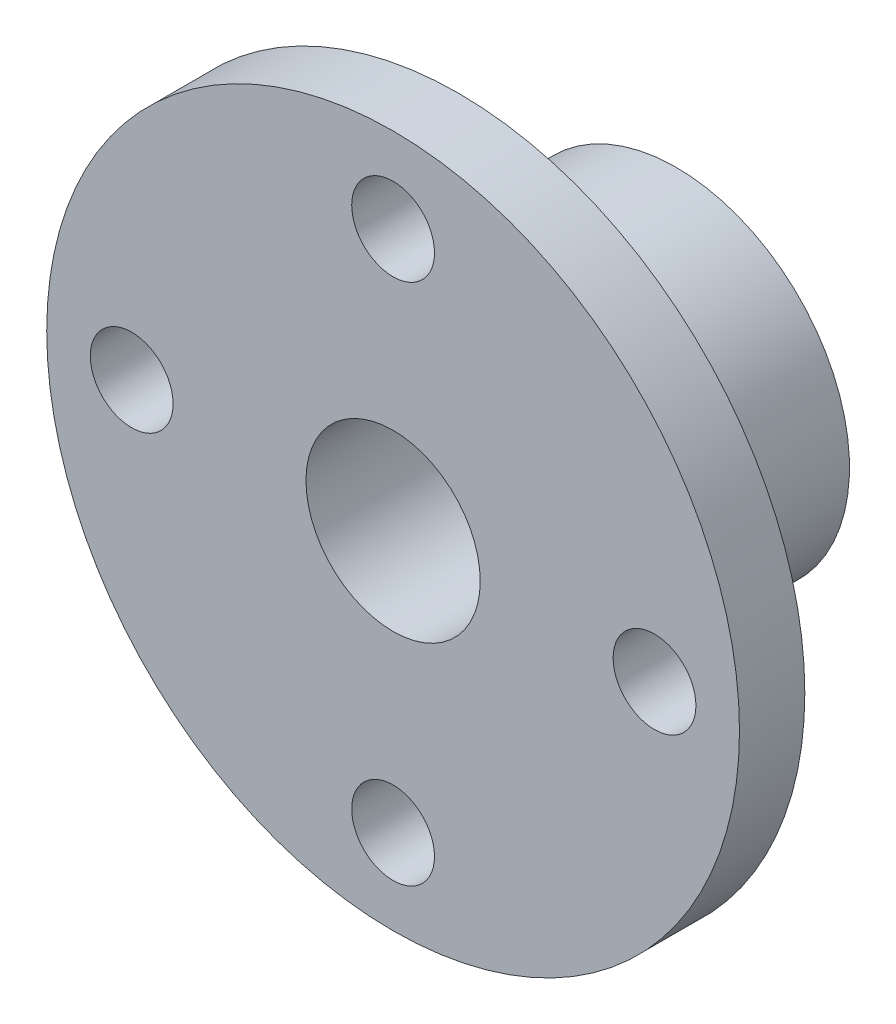
ISO-10303-21;
HEADER;
FILE_DESCRIPTION(('STEP AP214'),'2;1');
FILE_NAME('part.step','',(''),(''),'','','');
FILE_SCHEMA(('AUTOMOTIVE_DESIGN { 1 0 10303 214 1 1 1 1 }'));
ENDSEC;
DATA;
#1=APPLICATION_CONTEXT('core data for automotive mechanical design processes');
#2=APPLICATION_PROTOCOL_DEFINITION('international standard','automotive_design',2000,#1);
#3=PRODUCT_CONTEXT('',#1,'mechanical');
#4=PRODUCT('Part','Part','',(#3));
#5=PRODUCT_RELATED_PRODUCT_CATEGORY('part','',(#4));
#6=PRODUCT_DEFINITION_FORMATION('','',#4);
#7=PRODUCT_DEFINITION_CONTEXT('part definition',#1,'design');
#8=PRODUCT_DEFINITION('design','',#6,#7);
#9=PRODUCT_DEFINITION_SHAPE('','',#8);
#10=(LENGTH_UNIT() NAMED_UNIT(*) SI_UNIT(.MILLI.,.METRE.));
#11=(NAMED_UNIT(*) PLANE_ANGLE_UNIT() SI_UNIT($,.RADIAN.));
#12=(NAMED_UNIT(*) SI_UNIT($,.STERADIAN.) SOLID_ANGLE_UNIT());
#13=UNCERTAINTY_MEASURE_WITH_UNIT(LENGTH_MEASURE(1.E-05),#10,'distance_accuracy_value','');
#14=(GEOMETRIC_REPRESENTATION_CONTEXT(3) GLOBAL_UNCERTAINTY_ASSIGNED_CONTEXT((#13)) GLOBAL_UNIT_ASSIGNED_CONTEXT((#10,
#11,#12)) REPRESENTATION_CONTEXT('',''));
#15=CARTESIAN_POINT('',(0.,0.,0.));
#16=DIRECTION('',(0.,0.,1.));
#17=DIRECTION('',(1.,0.,0.));
#18=AXIS2_PLACEMENT_3D('',#15,#16,#17);
#19=CARTESIAN_POINT('',(0.,0.,3.));
#20=DIRECTION('',(0.,0.,-1.));
#21=DIRECTION('',(-1.,0.,0.));
#22=AXIS2_PLACEMENT_3D('',#19,#20,#21);
#23=CYLINDRICAL_SURFACE('',#22,15.9);
#24=CARTESIAN_POINT('',(0.,0.,3.));
#25=DIRECTION('',(0.,0.,1.));
#26=DIRECTION('',(1.,0.,0.));
#27=AXIS2_PLACEMENT_3D('',#24,#25,#26);
#28=CIRCLE('',#27,15.9);
#29=CARTESIAN_POINT('',(15.9,0.,3.));
#30=VERTEX_POINT('',#29);
#31=EDGE_CURVE('E39',#30,#30,#28,.T.);
#32=ORIENTED_EDGE('',*,*,#31,.F.);
#33=EDGE_LOOP('',(#32));
#34=FACE_BOUND('',#33,.T.);
#35=CARTESIAN_POINT('',(0.,0.,0.));
#36=DIRECTION('',(0.,0.,1.));
#37=DIRECTION('',(1.,0.,0.));
#38=AXIS2_PLACEMENT_3D('',#35,#36,#37);
#39=CIRCLE('',#38,15.9);
#40=CARTESIAN_POINT('',(15.9,0.,0.));
#41=VERTEX_POINT('',#40);
#42=EDGE_CURVE('E35',#41,#41,#39,.T.);
#43=ORIENTED_EDGE('',*,*,#42,.T.);
#44=EDGE_LOOP('',(#43));
#45=FACE_BOUND('',#44,.T.);
#46=ADVANCED_FACE('F32',(#34,#45),#23,.T.);
#47=CARTESIAN_POINT('',(0.,0.,3.));
#48=DIRECTION('',(0.,0.,1.));
#49=DIRECTION('',(1.,0.,0.));
#50=AXIS2_PLACEMENT_3D('',#47,#48,#49);
#51=PLANE('',#50);
#52=CARTESIAN_POINT('',(0.,12.,3.));
#53=DIRECTION('',(0.,0.,1.));
#54=DIRECTION('',(1.,0.,0.));
#55=AXIS2_PLACEMENT_3D('',#52,#53,#54);
#56=CIRCLE('',#55,1.9);
#57=CARTESIAN_POINT('',(1.9,12.,3.));
#58=VERTEX_POINT('',#57);
#59=EDGE_CURVE('E54',#58,#58,#56,.T.);
#60=ORIENTED_EDGE('',*,*,#59,.F.);
#61=EDGE_LOOP('',(#60));
#62=FACE_BOUND('',#61,.T.);
#63=CARTESIAN_POINT('',(12.,0.,3.));
#64=DIRECTION('',(0.,0.,1.));
#65=DIRECTION('',(1.,0.,0.));
#66=AXIS2_PLACEMENT_3D('',#63,#64,#65);
#67=CIRCLE('',#66,1.9);
#68=CARTESIAN_POINT('',(13.9,0.,3.));
#69=VERTEX_POINT('',#68);
#70=EDGE_CURVE('E57',#69,#69,#67,.T.);
#71=ORIENTED_EDGE('',*,*,#70,.F.);
#72=EDGE_LOOP('',(#71));
#73=FACE_BOUND('',#72,.T.);
#74=CARTESIAN_POINT('',(-12.,0.,3.));
#75=DIRECTION('',(0.,0.,1.));
#76=DIRECTION('',(1.,0.,0.));
#77=AXIS2_PLACEMENT_3D('',#74,#75,#76);
#78=CIRCLE('',#77,1.9);
#79=CARTESIAN_POINT('',(-10.1,0.,3.));
#80=VERTEX_POINT('',#79);
#81=EDGE_CURVE('E60',#80,#80,#78,.T.);
#82=ORIENTED_EDGE('',*,*,#81,.F.);
#83=EDGE_LOOP('',(#82));
#84=FACE_BOUND('',#83,.T.);
#85=CARTESIAN_POINT('',(0.,-12.,3.));
#86=DIRECTION('',(0.,0.,1.));
#87=DIRECTION('',(1.,0.,0.));
#88=AXIS2_PLACEMENT_3D('',#85,#86,#87);
#89=CIRCLE('',#88,1.9);
#90=CARTESIAN_POINT('',(1.9,-12.,3.));
#91=VERTEX_POINT('',#90);
#92=EDGE_CURVE('E63',#91,#91,#89,.T.);
#93=ORIENTED_EDGE('',*,*,#92,.F.);
#94=EDGE_LOOP('',(#93));
#95=FACE_BOUND('',#94,.T.);
#96=CARTESIAN_POINT('',(0.,0.,3.));
#97=DIRECTION('',(0.,0.,1.));
#98=DIRECTION('',(1.,0.,0.));
#99=AXIS2_PLACEMENT_3D('',#96,#97,#98);
#100=CIRCLE('',#99,4.);
#101=CARTESIAN_POINT('',(4.,0.,3.));
#102=VERTEX_POINT('',#101);
#103=EDGE_CURVE('E48',#102,#102,#100,.T.);
#104=ORIENTED_EDGE('',*,*,#103,.F.);
#105=EDGE_LOOP('',(#104));
#106=FACE_BOUND('',#105,.T.);
#107=ORIENTED_EDGE('',*,*,#31,.T.);
#108=EDGE_LOOP('',(#107));
#109=FACE_BOUND('',#108,.T.);
#110=ADVANCED_FACE('F85',(#62,#73,#84,#95,#106,#109),#51,.T.);
#111=CARTESIAN_POINT('',(0.,0.,0.));
#112=DIRECTION('',(0.,0.,1.));
#113=DIRECTION('',(1.,0.,0.));
#114=AXIS2_PLACEMENT_3D('',#111,#112,#113);
#115=PLANE('',#114);
#116=CARTESIAN_POINT('',(0.,12.,0.));
#117=DIRECTION('',(0.,0.,-1.));
#118=DIRECTION('',(-1.,0.,0.));
#119=AXIS2_PLACEMENT_3D('',#116,#117,#118);
#120=CIRCLE('',#119,1.9);
#121=CARTESIAN_POINT('',(-1.9,12.,0.));
#122=VERTEX_POINT('',#121);
#123=EDGE_CURVE('E66',#122,#122,#120,.T.);
#124=ORIENTED_EDGE('',*,*,#123,.F.);
#125=EDGE_LOOP('',(#124));
#126=FACE_BOUND('',#125,.T.);
#127=CARTESIAN_POINT('',(12.,0.,0.));
#128=DIRECTION('',(0.,0.,-1.));
#129=DIRECTION('',(-1.,0.,0.));
#130=AXIS2_PLACEMENT_3D('',#127,#128,#129);
#131=CIRCLE('',#130,1.9);
#132=CARTESIAN_POINT('',(10.1,0.,0.));
#133=VERTEX_POINT('',#132);
#134=EDGE_CURVE('E73',#133,#133,#131,.T.);
#135=ORIENTED_EDGE('',*,*,#134,.F.);
#136=EDGE_LOOP('',(#135));
#137=FACE_BOUND('',#136,.T.);
#138=CARTESIAN_POINT('',(-12.,0.,0.));
#139=DIRECTION('',(0.,0.,-1.));
#140=DIRECTION('',(1.,0.,0.));
#141=AXIS2_PLACEMENT_3D('',#138,#139,#140);
#142=CIRCLE('',#141,1.9);
#143=CARTESIAN_POINT('',(-10.1,0.,0.));
#144=VERTEX_POINT('',#143);
#145=EDGE_CURVE('E70',#144,#144,#142,.T.);
#146=ORIENTED_EDGE('',*,*,#145,.F.);
#147=EDGE_LOOP('',(#146));
#148=FACE_BOUND('',#147,.T.);
#149=CARTESIAN_POINT('',(0.,-12.,0.));
#150=DIRECTION('',(0.,0.,-1.));
#151=DIRECTION('',(1.,0.,0.));
#152=AXIS2_PLACEMENT_3D('',#149,#150,#151);
#153=CIRCLE('',#152,1.9);
#154=CARTESIAN_POINT('',(1.9,-12.,0.));
#155=VERTEX_POINT('',#154);
#156=EDGE_CURVE('E67',#155,#155,#153,.T.);
#157=ORIENTED_EDGE('',*,*,#156,.F.);
#158=EDGE_LOOP('',(#157));
#159=FACE_BOUND('',#158,.T.);
#160=CARTESIAN_POINT('',(0.,0.,0.));
#161=DIRECTION('',(0.,0.,-1.));
#162=DIRECTION('',(-1.,0.,0.));
#163=AXIS2_PLACEMENT_3D('',#160,#161,#162);
#164=CIRCLE('',#163,7.95);
#165=CARTESIAN_POINT('',(-7.95,0.,0.));
#166=VERTEX_POINT('',#165);
#167=EDGE_CURVE('E10',#166,#166,#164,.T.);
#168=ORIENTED_EDGE('',*,*,#167,.F.);
#169=EDGE_LOOP('',(#168));
#170=FACE_BOUND('',#169,.T.);
#171=ORIENTED_EDGE('',*,*,#42,.F.);
#172=EDGE_LOOP('',(#171));
#173=FACE_BOUND('',#172,.T.);
#174=ADVANCED_FACE('F81',(#126,#137,#148,#159,#170,#173),#115,.F.);
#175=CARTESIAN_POINT('',(0.,0.,-10.));
#176=DIRECTION('',(0.,0.,1.));
#177=DIRECTION('',(1.,0.,0.));
#178=AXIS2_PLACEMENT_3D('',#175,#176,#177);
#179=CYLINDRICAL_SURFACE('',#178,7.95);
#180=CARTESIAN_POINT('',(0.,0.,-10.));
#181=DIRECTION('',(0.,0.,-1.));
#182=DIRECTION('',(-1.,0.,0.));
#183=AXIS2_PLACEMENT_3D('',#180,#181,#182);
#184=CIRCLE('',#183,7.95);
#185=CARTESIAN_POINT('',(-7.95,0.,-10.));
#186=VERTEX_POINT('',#185);
#187=EDGE_CURVE('E45',#186,#186,#184,.T.);
#188=ORIENTED_EDGE('',*,*,#187,.F.);
#189=EDGE_LOOP('',(#188));
#190=FACE_BOUND('',#189,.T.);
#191=ORIENTED_EDGE('',*,*,#167,.T.);
#192=EDGE_LOOP('',(#191));
#193=FACE_BOUND('',#192,.T.);
#194=ADVANCED_FACE('F84',(#190,#193),#179,.T.);
#195=CARTESIAN_POINT('',(0.,0.,-10.));
#196=DIRECTION('',(0.,0.,-1.));
#197=DIRECTION('',(-1.,0.,0.));
#198=AXIS2_PLACEMENT_3D('',#195,#196,#197);
#199=PLANE('',#198);
#200=CARTESIAN_POINT('',(0.,0.,-10.));
#201=DIRECTION('',(0.,0.,-1.));
#202=DIRECTION('',(-1.,0.,0.));
#203=AXIS2_PLACEMENT_3D('',#200,#201,#202);
#204=CIRCLE('',#203,4.);
#205=CARTESIAN_POINT('',(-4.,0.,-10.));
#206=VERTEX_POINT('',#205);
#207=EDGE_CURVE('E51',#206,#206,#204,.T.);
#208=ORIENTED_EDGE('',*,*,#207,.F.);
#209=EDGE_LOOP('',(#208));
#210=FACE_BOUND('',#209,.T.);
#211=ORIENTED_EDGE('',*,*,#187,.T.);
#212=EDGE_LOOP('',(#211));
#213=FACE_BOUND('',#212,.T.);
#214=ADVANCED_FACE('F112',(#210,#213),#199,.T.);
#215=CARTESIAN_POINT('',(0.,0.,10.));
#216=DIRECTION('',(0.,0.,-1.));
#217=DIRECTION('',(-1.,0.,0.));
#218=AXIS2_PLACEMENT_3D('',#215,#216,#217);
#219=CYLINDRICAL_SURFACE('',#218,4.);
#220=ORIENTED_EDGE('',*,*,#103,.T.);
#221=EDGE_LOOP('',(#220));
#222=FACE_BOUND('',#221,.T.);
#223=ORIENTED_EDGE('',*,*,#207,.T.);
#224=EDGE_LOOP('',(#223));
#225=FACE_BOUND('',#224,.T.);
#226=ADVANCED_FACE('F116',(#222,#225),#219,.F.);
#227=CARTESIAN_POINT('',(0.,-12.,20.));
#228=DIRECTION('',(0.,0.,-1.));
#229=DIRECTION('',(-1.,0.,0.));
#230=AXIS2_PLACEMENT_3D('',#227,#228,#229);
#231=CYLINDRICAL_SURFACE('',#230,1.9);
#232=ORIENTED_EDGE('',*,*,#92,.T.);
#233=EDGE_LOOP('',(#232));
#234=FACE_BOUND('',#233,.T.);
#235=ORIENTED_EDGE('',*,*,#156,.T.);
#236=EDGE_LOOP('',(#235));
#237=FACE_BOUND('',#236,.T.);
#238=ADVANCED_FACE('F120',(#234,#237),#231,.F.);
#239=CARTESIAN_POINT('',(-12.,0.,20.));
#240=DIRECTION('',(0.,0.,-1.));
#241=DIRECTION('',(-1.,0.,0.));
#242=AXIS2_PLACEMENT_3D('',#239,#240,#241);
#243=CYLINDRICAL_SURFACE('',#242,1.9);
#244=ORIENTED_EDGE('',*,*,#81,.T.);
#245=EDGE_LOOP('',(#244));
#246=FACE_BOUND('',#245,.T.);
#247=ORIENTED_EDGE('',*,*,#145,.T.);
#248=EDGE_LOOP('',(#247));
#249=FACE_BOUND('',#248,.T.);
#250=ADVANCED_FACE('F124',(#246,#249),#243,.F.);
#251=CARTESIAN_POINT('',(12.,0.,20.));
#252=DIRECTION('',(0.,0.,-1.));
#253=DIRECTION('',(-1.,0.,0.));
#254=AXIS2_PLACEMENT_3D('',#251,#252,#253);
#255=CYLINDRICAL_SURFACE('',#254,1.9);
#256=ORIENTED_EDGE('',*,*,#70,.T.);
#257=EDGE_LOOP('',(#256));
#258=FACE_BOUND('',#257,.T.);
#259=ORIENTED_EDGE('',*,*,#134,.T.);
#260=EDGE_LOOP('',(#259));
#261=FACE_BOUND('',#260,.T.);
#262=ADVANCED_FACE('F128',(#258,#261),#255,.F.);
#263=CARTESIAN_POINT('',(0.,12.,20.));
#264=DIRECTION('',(0.,0.,-1.));
#265=DIRECTION('',(-1.,0.,0.));
#266=AXIS2_PLACEMENT_3D('',#263,#264,#265);
#267=CYLINDRICAL_SURFACE('',#266,1.9);
#268=ORIENTED_EDGE('',*,*,#59,.T.);
#269=EDGE_LOOP('',(#268));
#270=FACE_BOUND('',#269,.T.);
#271=ORIENTED_EDGE('',*,*,#123,.T.);
#272=EDGE_LOOP('',(#271));
#273=FACE_BOUND('',#272,.T.);
#274=ADVANCED_FACE('F79',(#270,#273),#267,.F.);
#275=CLOSED_SHELL('',(#46,#110,#174,#194,#214,#226,#238,#250,#262,#274));
#276=MANIFOLD_SOLID_BREP('B2',#275);
#277=ADVANCED_BREP_SHAPE_REPRESENTATION('',(#18,#276),#14);
#278=SHAPE_DEFINITION_REPRESENTATION(#9,#277);
ENDSEC;
END-ISO-10303-21;
